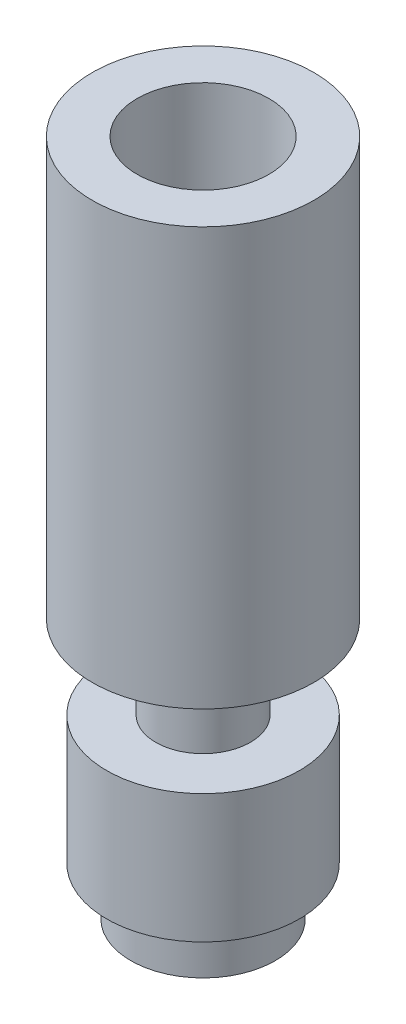
ISO-10303-21;
HEADER;
FILE_DESCRIPTION(('STEP AP214'),'2;1');
FILE_NAME('part.step','',(''),(''),'','','');
FILE_SCHEMA(('AUTOMOTIVE_DESIGN { 1 0 10303 214 1 1 1 1 }'));
ENDSEC;
DATA;
#1=APPLICATION_CONTEXT('core data for automotive mechanical design processes');
#2=APPLICATION_PROTOCOL_DEFINITION('international standard','automotive_design',2000,#1);
#3=PRODUCT_CONTEXT('',#1,'mechanical');
#4=PRODUCT('Part','Part','',(#3));
#5=PRODUCT_RELATED_PRODUCT_CATEGORY('part','',(#4));
#6=PRODUCT_DEFINITION_FORMATION('','',#4);
#7=PRODUCT_DEFINITION_CONTEXT('part definition',#1,'design');
#8=PRODUCT_DEFINITION('design','',#6,#7);
#9=PRODUCT_DEFINITION_SHAPE('','',#8);
#10=(LENGTH_UNIT() NAMED_UNIT(*) SI_UNIT(.MILLI.,.METRE.));
#11=(NAMED_UNIT(*) PLANE_ANGLE_UNIT() SI_UNIT($,.RADIAN.));
#12=(NAMED_UNIT(*) SI_UNIT($,.STERADIAN.) SOLID_ANGLE_UNIT());
#13=UNCERTAINTY_MEASURE_WITH_UNIT(LENGTH_MEASURE(1.E-05),#10,'distance_accuracy_value','');
#14=(GEOMETRIC_REPRESENTATION_CONTEXT(3) GLOBAL_UNCERTAINTY_ASSIGNED_CONTEXT((#13)) GLOBAL_UNIT_ASSIGNED_CONTEXT((#10,
#11,#12)) REPRESENTATION_CONTEXT('',''));
#15=CARTESIAN_POINT('',(0.,0.,0.));
#16=DIRECTION('',(0.,0.,1.));
#17=DIRECTION('',(1.,0.,0.));
#18=AXIS2_PLACEMENT_3D('',#15,#16,#17);
#19=CARTESIAN_POINT('',(0.,0.,0.));
#20=DIRECTION('',(0.,-1.,0.));
#21=DIRECTION('',(0.,0.,-1.));
#22=AXIS2_PLACEMENT_3D('',#19,#20,#21);
#23=CYLINDRICAL_SURFACE('',#22,1.);
#24=CARTESIAN_POINT('',(0.,16.5417050967555,0.));
#25=DIRECTION('',(0.,-1.,0.));
#26=DIRECTION('',(0.,0.,-1.));
#27=AXIS2_PLACEMENT_3D('',#24,#25,#26);
#28=CIRCLE('',#27,1.);
#29=CARTESIAN_POINT('',(0.,16.5417050967555,-1.));
#30=VERTEX_POINT('',#29);
#31=EDGE_CURVE('E10',#30,#30,#28,.T.);
#32=ORIENTED_EDGE('',*,*,#31,.F.);
#33=EDGE_LOOP('',(#32));
#34=FACE_BOUND('',#33,.T.);
#35=CARTESIAN_POINT('',(0.,0.,0.));
#36=DIRECTION('',(0.,-1.,0.));
#37=DIRECTION('',(0.,0.,-1.));
#38=AXIS2_PLACEMENT_3D('',#35,#36,#37);
#39=CIRCLE('',#38,1.);
#40=CARTESIAN_POINT('',(0.,0.,-1.));
#41=VERTEX_POINT('',#40);
#42=EDGE_CURVE('E70',#41,#41,#39,.T.);
#43=ORIENTED_EDGE('',*,*,#42,.T.);
#44=EDGE_LOOP('',(#43));
#45=FACE_BOUND('',#44,.T.);
#46=ADVANCED_FACE('F30',(#34,#45),#23,.F.);
#47=CARTESIAN_POINT('',(0.,16.5417050967555,0.));
#48=DIRECTION('',(0.,1.,0.));
#49=DIRECTION('',(0.,0.,1.));
#50=AXIS2_PLACEMENT_3D('',#47,#48,#49);
#51=CONICAL_SURFACE('',#50,1.,1.08210413623649);
#52=CARTESIAN_POINT('',(0.,17.1,0.));
#53=DIRECTION('',(0.,-1.,0.));
#54=DIRECTION('',(0.,0.,-1.));
#55=AXIS2_PLACEMENT_3D('',#52,#53,#54);
#56=CIRCLE('',#55,2.05);
#57=CARTESIAN_POINT('',(0.,17.1,-2.05));
#58=VERTEX_POINT('',#57);
#59=EDGE_CURVE('E36',#58,#58,#56,.T.);
#60=ORIENTED_EDGE('',*,*,#59,.F.);
#61=EDGE_LOOP('',(#60));
#62=FACE_BOUND('',#61,.T.);
#63=ORIENTED_EDGE('',*,*,#31,.T.);
#64=EDGE_LOOP('',(#63));
#65=FACE_BOUND('',#64,.T.);
#66=ADVANCED_FACE('F131',(#62,#65),#51,.F.);
#67=CARTESIAN_POINT('',(0.,0.,0.));
#68=DIRECTION('',(0.,-1.,0.));
#69=DIRECTION('',(0.,0.,-1.));
#70=AXIS2_PLACEMENT_3D('',#67,#68,#69);
#71=CYLINDRICAL_SURFACE('',#70,2.05);
#72=CARTESIAN_POINT('',(0.,21.1,0.));
#73=DIRECTION('',(0.,-1.,0.));
#74=DIRECTION('',(0.,0.,-1.));
#75=AXIS2_PLACEMENT_3D('',#72,#73,#74);
#76=CIRCLE('',#75,2.05);
#77=CARTESIAN_POINT('',(0.,21.1,-2.05));
#78=VERTEX_POINT('',#77);
#79=EDGE_CURVE('E40',#78,#78,#76,.T.);
#80=ORIENTED_EDGE('',*,*,#79,.F.);
#81=EDGE_LOOP('',(#80));
#82=FACE_BOUND('',#81,.T.);
#83=ORIENTED_EDGE('',*,*,#59,.T.);
#84=EDGE_LOOP('',(#83));
#85=FACE_BOUND('',#84,.T.);
#86=ADVANCED_FACE('F126',(#82,#85),#71,.F.);
#87=CARTESIAN_POINT('',(-2.05,21.1,0.));
#88=DIRECTION('',(0.,-1.,0.));
#89=DIRECTION('',(0.,0.,-1.));
#90=AXIS2_PLACEMENT_3D('',#87,#88,#89);
#91=PLANE('',#90);
#92=CARTESIAN_POINT('',(0.,21.1,0.));
#93=DIRECTION('',(0.,-1.,0.));
#94=DIRECTION('',(0.,0.,-1.));
#95=AXIS2_PLACEMENT_3D('',#92,#93,#94);
#96=CIRCLE('',#95,3.45);
#97=CARTESIAN_POINT('',(0.,21.1,-3.45));
#98=VERTEX_POINT('',#97);
#99=EDGE_CURVE('E44',#98,#98,#96,.T.);
#100=ORIENTED_EDGE('',*,*,#99,.F.);
#101=EDGE_LOOP('',(#100));
#102=FACE_BOUND('',#101,.T.);
#103=ORIENTED_EDGE('',*,*,#79,.T.);
#104=EDGE_LOOP('',(#103));
#105=FACE_BOUND('',#104,.T.);
#106=ADVANCED_FACE('F120',(#102,#105),#91,.F.);
#107=CARTESIAN_POINT('',(0.,0.,0.));
#108=DIRECTION('',(0.,-1.,0.));
#109=DIRECTION('',(0.,0.,-1.));
#110=AXIS2_PLACEMENT_3D('',#107,#108,#109);
#111=CYLINDRICAL_SURFACE('',#110,3.45);
#112=CARTESIAN_POINT('',(0.,8.1,0.));
#113=DIRECTION('',(0.,-1.,0.));
#114=DIRECTION('',(0.,0.,-1.));
#115=AXIS2_PLACEMENT_3D('',#112,#113,#114);
#116=CIRCLE('',#115,3.45);
#117=CARTESIAN_POINT('',(0.,8.1,-3.45));
#118=VERTEX_POINT('',#117);
#119=EDGE_CURVE('E49',#118,#118,#116,.T.);
#120=ORIENTED_EDGE('',*,*,#119,.F.);
#121=EDGE_LOOP('',(#120));
#122=FACE_BOUND('',#121,.T.);
#123=ORIENTED_EDGE('',*,*,#99,.T.);
#124=EDGE_LOOP('',(#123));
#125=FACE_BOUND('',#124,.T.);
#126=ADVANCED_FACE('F114',(#122,#125),#111,.T.);
#127=CARTESIAN_POINT('',(-1.475,8.1,0.));
#128=DIRECTION('',(0.,1.,0.));
#129=DIRECTION('',(0.,0.,1.));
#130=AXIS2_PLACEMENT_3D('',#127,#128,#129);
#131=PLANE('',#130);
#132=CARTESIAN_POINT('',(0.,8.1,0.));
#133=DIRECTION('',(0.,-1.,0.));
#134=DIRECTION('',(0.,0.,-1.));
#135=AXIS2_PLACEMENT_3D('',#132,#133,#134);
#136=CIRCLE('',#135,1.475);
#137=CARTESIAN_POINT('',(0.,8.1,-1.475));
#138=VERTEX_POINT('',#137);
#139=EDGE_CURVE('E52',#138,#138,#136,.T.);
#140=ORIENTED_EDGE('',*,*,#139,.F.);
#141=EDGE_LOOP('',(#140));
#142=FACE_BOUND('',#141,.T.);
#143=ORIENTED_EDGE('',*,*,#119,.T.);
#144=EDGE_LOOP('',(#143));
#145=FACE_BOUND('',#144,.T.);
#146=ADVANCED_FACE('F108',(#142,#145),#131,.F.);
#147=CARTESIAN_POINT('',(0.,0.,0.));
#148=DIRECTION('',(0.,-1.,0.));
#149=DIRECTION('',(0.,0.,-1.));
#150=AXIS2_PLACEMENT_3D('',#147,#148,#149);
#151=CYLINDRICAL_SURFACE('',#150,1.475);
#152=CARTESIAN_POINT('',(0.,5.5,0.));
#153=DIRECTION('',(0.,-1.,0.));
#154=DIRECTION('',(0.,0.,-1.));
#155=AXIS2_PLACEMENT_3D('',#152,#153,#154);
#156=CIRCLE('',#155,1.475);
#157=CARTESIAN_POINT('',(0.,5.5,-1.475));
#158=VERTEX_POINT('',#157);
#159=EDGE_CURVE('E55',#158,#158,#156,.T.);
#160=ORIENTED_EDGE('',*,*,#159,.F.);
#161=EDGE_LOOP('',(#160));
#162=FACE_BOUND('',#161,.T.);
#163=ORIENTED_EDGE('',*,*,#139,.T.);
#164=EDGE_LOOP('',(#163));
#165=FACE_BOUND('',#164,.T.);
#166=ADVANCED_FACE('F102',(#162,#165),#151,.T.);
#167=CARTESIAN_POINT('',(-3.,5.5,0.));
#168=DIRECTION('',(0.,-1.,0.));
#169=DIRECTION('',(0.,0.,-1.));
#170=AXIS2_PLACEMENT_3D('',#167,#168,#169);
#171=PLANE('',#170);
#172=CARTESIAN_POINT('',(0.,5.5,0.));
#173=DIRECTION('',(0.,-1.,0.));
#174=DIRECTION('',(0.,0.,-1.));
#175=AXIS2_PLACEMENT_3D('',#172,#173,#174);
#176=CIRCLE('',#175,3.);
#177=CARTESIAN_POINT('',(0.,5.5,-3.));
#178=VERTEX_POINT('',#177);
#179=EDGE_CURVE('E58',#178,#178,#176,.T.);
#180=ORIENTED_EDGE('',*,*,#179,.F.);
#181=EDGE_LOOP('',(#180));
#182=FACE_BOUND('',#181,.T.);
#183=ORIENTED_EDGE('',*,*,#159,.T.);
#184=EDGE_LOOP('',(#183));
#185=FACE_BOUND('',#184,.T.);
#186=ADVANCED_FACE('F96',(#182,#185),#171,.F.);
#187=CARTESIAN_POINT('',(0.,0.,0.));
#188=DIRECTION('',(0.,-1.,0.));
#189=DIRECTION('',(0.,0.,-1.));
#190=AXIS2_PLACEMENT_3D('',#187,#188,#189);
#191=CYLINDRICAL_SURFACE('',#190,3.);
#192=CARTESIAN_POINT('',(0.,1.5,0.));
#193=DIRECTION('',(0.,-1.,0.));
#194=DIRECTION('',(0.,0.,-1.));
#195=AXIS2_PLACEMENT_3D('',#192,#193,#194);
#196=CIRCLE('',#195,3.);
#197=CARTESIAN_POINT('',(0.,1.5,-3.));
#198=VERTEX_POINT('',#197);
#199=EDGE_CURVE('E61',#198,#198,#196,.T.);
#200=ORIENTED_EDGE('',*,*,#199,.F.);
#201=EDGE_LOOP('',(#200));
#202=FACE_BOUND('',#201,.T.);
#203=ORIENTED_EDGE('',*,*,#179,.T.);
#204=EDGE_LOOP('',(#203));
#205=FACE_BOUND('',#204,.T.);
#206=ADVANCED_FACE('F90',(#202,#205),#191,.T.);
#207=CARTESIAN_POINT('',(-2.25,1.5,0.));
#208=DIRECTION('',(0.,1.,0.));
#209=DIRECTION('',(0.,0.,1.));
#210=AXIS2_PLACEMENT_3D('',#207,#208,#209);
#211=PLANE('',#210);
#212=CARTESIAN_POINT('',(0.,1.5,0.));
#213=DIRECTION('',(0.,-1.,0.));
#214=DIRECTION('',(0.,0.,-1.));
#215=AXIS2_PLACEMENT_3D('',#212,#213,#214);
#216=CIRCLE('',#215,2.25);
#217=CARTESIAN_POINT('',(0.,1.5,-2.25));
#218=VERTEX_POINT('',#217);
#219=EDGE_CURVE('E64',#218,#218,#216,.T.);
#220=ORIENTED_EDGE('',*,*,#219,.F.);
#221=EDGE_LOOP('',(#220));
#222=FACE_BOUND('',#221,.T.);
#223=ORIENTED_EDGE('',*,*,#199,.T.);
#224=EDGE_LOOP('',(#223));
#225=FACE_BOUND('',#224,.T.);
#226=ADVANCED_FACE('F84',(#222,#225),#211,.F.);
#227=CARTESIAN_POINT('',(0.,0.,0.));
#228=DIRECTION('',(0.,-1.,0.));
#229=DIRECTION('',(0.,0.,-1.));
#230=AXIS2_PLACEMENT_3D('',#227,#228,#229);
#231=CYLINDRICAL_SURFACE('',#230,2.25);
#232=CARTESIAN_POINT('',(0.,0.,0.));
#233=DIRECTION('',(0.,-1.,0.));
#234=DIRECTION('',(0.,0.,-1.));
#235=AXIS2_PLACEMENT_3D('',#232,#233,#234);
#236=CIRCLE('',#235,2.25);
#237=CARTESIAN_POINT('',(0.,0.,-2.25));
#238=VERTEX_POINT('',#237);
#239=EDGE_CURVE('E67',#238,#238,#236,.T.);
#240=ORIENTED_EDGE('',*,*,#239,.F.);
#241=EDGE_LOOP('',(#240));
#242=FACE_BOUND('',#241,.T.);
#243=ORIENTED_EDGE('',*,*,#219,.T.);
#244=EDGE_LOOP('',(#243));
#245=FACE_BOUND('',#244,.T.);
#246=ADVANCED_FACE('F78',(#242,#245),#231,.T.);
#247=CARTESIAN_POINT('',(-1.,0.,0.));
#248=DIRECTION('',(0.,1.,0.));
#249=DIRECTION('',(0.,0.,1.));
#250=AXIS2_PLACEMENT_3D('',#247,#248,#249);
#251=PLANE('',#250);
#252=ORIENTED_EDGE('',*,*,#42,.F.);
#253=EDGE_LOOP('',(#252));
#254=FACE_BOUND('',#253,.T.);
#255=ORIENTED_EDGE('',*,*,#239,.T.);
#256=EDGE_LOOP('',(#255));
#257=FACE_BOUND('',#256,.T.);
#258=ADVANCED_FACE('F75',(#254,#257),#251,.F.);
#259=CLOSED_SHELL('',(#46,#66,#86,#106,#126,#146,#166,#186,#206,#226,#246,#258));
#260=MANIFOLD_SOLID_BREP('B2',#259);
#261=ADVANCED_BREP_SHAPE_REPRESENTATION('',(#18,#260),#14);
#262=SHAPE_DEFINITION_REPRESENTATION(#9,#261);
ENDSEC;
END-ISO-10303-21;
